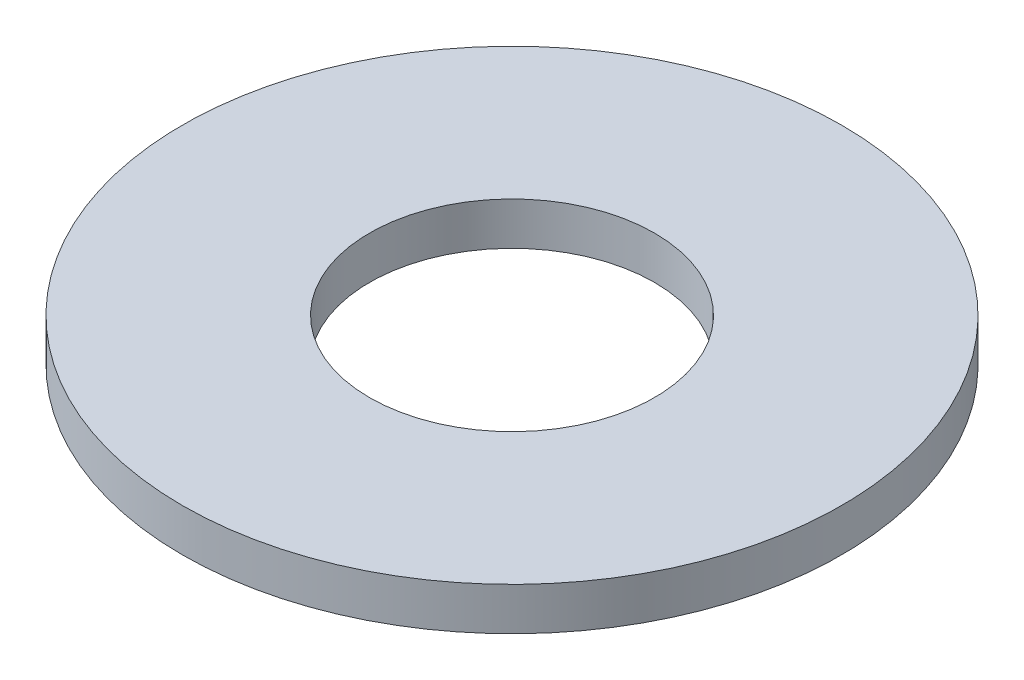
ISO-10303-21;
HEADER;
FILE_DESCRIPTION(('STEP AP214'),'2;1');
FILE_NAME('part.step','',(''),(''),'','','');
FILE_SCHEMA(('AUTOMOTIVE_DESIGN { 1 0 10303 214 1 1 1 1 }'));
ENDSEC;
DATA;
#1=APPLICATION_CONTEXT('core data for automotive mechanical design processes');
#2=APPLICATION_PROTOCOL_DEFINITION('international standard','automotive_design',2000,#1);
#3=PRODUCT_CONTEXT('',#1,'mechanical');
#4=PRODUCT('Part','Part','',(#3));
#5=PRODUCT_RELATED_PRODUCT_CATEGORY('part','',(#4));
#6=PRODUCT_DEFINITION_FORMATION('','',#4);
#7=PRODUCT_DEFINITION_CONTEXT('part definition',#1,'design');
#8=PRODUCT_DEFINITION('design','',#6,#7);
#9=PRODUCT_DEFINITION_SHAPE('','',#8);
#10=(LENGTH_UNIT() NAMED_UNIT(*) SI_UNIT(.MILLI.,.METRE.));
#11=(NAMED_UNIT(*) PLANE_ANGLE_UNIT() SI_UNIT($,.RADIAN.));
#12=(NAMED_UNIT(*) SI_UNIT($,.STERADIAN.) SOLID_ANGLE_UNIT());
#13=UNCERTAINTY_MEASURE_WITH_UNIT(LENGTH_MEASURE(1.E-05),#10,'distance_accuracy_value','');
#14=(GEOMETRIC_REPRESENTATION_CONTEXT(3) GLOBAL_UNCERTAINTY_ASSIGNED_CONTEXT((#13)) GLOBAL_UNIT_ASSIGNED_CONTEXT((#10,
#11,#12)) REPRESENTATION_CONTEXT('',''));
#15=CARTESIAN_POINT('',(0.,0.,0.));
#16=DIRECTION('',(0.,0.,1.));
#17=DIRECTION('',(1.,0.,0.));
#18=AXIS2_PLACEMENT_3D('',#15,#16,#17);
#19=CARTESIAN_POINT('',(0.,12.,0.));
#20=DIRECTION('',(0.,-1.,0.));
#21=DIRECTION('',(0.,0.,-1.));
#22=AXIS2_PLACEMENT_3D('',#19,#20,#21);
#23=CYLINDRICAL_SURFACE('',#22,92.5);
#24=CARTESIAN_POINT('',(0.,12.,0.));
#25=DIRECTION('',(0.,1.,0.));
#26=DIRECTION('',(0.,0.,1.));
#27=AXIS2_PLACEMENT_3D('',#24,#25,#26);
#28=CIRCLE('',#27,92.5);
#29=CARTESIAN_POINT('',(0.,12.,92.5));
#30=VERTEX_POINT('',#29);
#31=EDGE_CURVE('E10',#30,#30,#28,.T.);
#32=ORIENTED_EDGE('',*,*,#31,.F.);
#33=EDGE_LOOP('',(#32));
#34=FACE_BOUND('',#33,.T.);
#35=CARTESIAN_POINT('',(0.,0.,0.));
#36=DIRECTION('',(0.,1.,0.));
#37=DIRECTION('',(0.,0.,1.));
#38=AXIS2_PLACEMENT_3D('',#35,#36,#37);
#39=CIRCLE('',#38,92.5);
#40=CARTESIAN_POINT('',(0.,0.,92.5));
#41=VERTEX_POINT('',#40);
#42=EDGE_CURVE('E37',#41,#41,#39,.T.);
#43=ORIENTED_EDGE('',*,*,#42,.T.);
#44=EDGE_LOOP('',(#43));
#45=FACE_BOUND('',#44,.T.);
#46=ADVANCED_FACE('F40',(#34,#45),#23,.T.);
#47=CARTESIAN_POINT('',(0.,12.,0.));
#48=DIRECTION('',(0.,1.,0.));
#49=DIRECTION('',(0.,0.,1.));
#50=AXIS2_PLACEMENT_3D('',#47,#48,#49);
#51=PLANE('',#50);
#52=CARTESIAN_POINT('',(0.,12.,0.));
#53=DIRECTION('',(0.,1.,0.));
#54=DIRECTION('',(0.,0.,1.));
#55=AXIS2_PLACEMENT_3D('',#52,#53,#54);
#56=CIRCLE('',#55,40.);
#57=CARTESIAN_POINT('',(0.,12.,40.));
#58=VERTEX_POINT('',#57);
#59=EDGE_CURVE('E50',#58,#58,#56,.T.);
#60=ORIENTED_EDGE('',*,*,#59,.F.);
#61=EDGE_LOOP('',(#60));
#62=FACE_BOUND('',#61,.T.);
#63=ORIENTED_EDGE('',*,*,#31,.T.);
#64=EDGE_LOOP('',(#63));
#65=FACE_BOUND('',#64,.T.);
#66=ADVANCED_FACE('F59',(#62,#65),#51,.T.);
#67=CARTESIAN_POINT('',(0.,0.,0.));
#68=DIRECTION('',(0.,1.,0.));
#69=DIRECTION('',(0.,0.,1.));
#70=AXIS2_PLACEMENT_3D('',#67,#68,#69);
#71=PLANE('',#70);
#72=CARTESIAN_POINT('',(0.,0.,0.));
#73=DIRECTION('',(0.,1.,0.));
#74=DIRECTION('',(0.,0.,1.));
#75=AXIS2_PLACEMENT_3D('',#72,#73,#74);
#76=CIRCLE('',#75,40.);
#77=CARTESIAN_POINT('',(0.,0.,40.));
#78=VERTEX_POINT('',#77);
#79=EDGE_CURVE('E47',#78,#78,#76,.T.);
#80=ORIENTED_EDGE('',*,*,#79,.T.);
#81=EDGE_LOOP('',(#80));
#82=FACE_BOUND('',#81,.T.);
#83=ORIENTED_EDGE('',*,*,#42,.F.);
#84=EDGE_LOOP('',(#83));
#85=FACE_BOUND('',#84,.T.);
#86=ADVANCED_FACE('F58',(#82,#85),#71,.F.);
#87=CARTESIAN_POINT('',(0.,12.,0.));
#88=DIRECTION('',(0.,-1.,0.));
#89=DIRECTION('',(0.,0.,-1.));
#90=AXIS2_PLACEMENT_3D('',#87,#88,#89);
#91=CYLINDRICAL_SURFACE('',#90,40.);
#92=ORIENTED_EDGE('',*,*,#59,.T.);
#93=EDGE_LOOP('',(#92));
#94=FACE_BOUND('',#93,.T.);
#95=ORIENTED_EDGE('',*,*,#79,.F.);
#96=EDGE_LOOP('',(#95));
#97=FACE_BOUND('',#96,.T.);
#98=ADVANCED_FACE('F54',(#94,#97),#91,.F.);
#99=CLOSED_SHELL('',(#46,#66,#86,#98));
#100=MANIFOLD_SOLID_BREP('B2',#99);
#101=ADVANCED_BREP_SHAPE_REPRESENTATION('',(#18,#100),#14);
#102=SHAPE_DEFINITION_REPRESENTATION(#9,#101);
ENDSEC;
END-ISO-10303-21;
